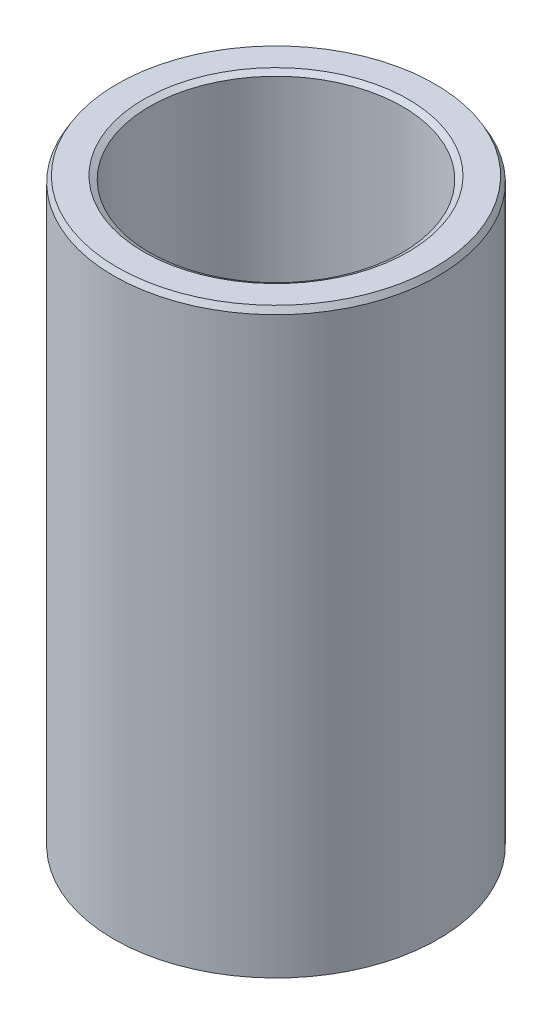
ISO-10303-21;
HEADER;
FILE_DESCRIPTION(('STEP AP214'),'2;1');
FILE_NAME('part.step','',(''),(''),'','','');
FILE_SCHEMA(('AUTOMOTIVE_DESIGN { 1 0 10303 214 1 1 1 1 }'));
ENDSEC;
DATA;
#1=APPLICATION_CONTEXT('core data for automotive mechanical design processes');
#2=APPLICATION_PROTOCOL_DEFINITION('international standard','automotive_design',2000,#1);
#3=PRODUCT_CONTEXT('',#1,'mechanical');
#4=PRODUCT('Part','Part','',(#3));
#5=PRODUCT_RELATED_PRODUCT_CATEGORY('part','',(#4));
#6=PRODUCT_DEFINITION_FORMATION('','',#4);
#7=PRODUCT_DEFINITION_CONTEXT('part definition',#1,'design');
#8=PRODUCT_DEFINITION('design','',#6,#7);
#9=PRODUCT_DEFINITION_SHAPE('','',#8);
#10=(LENGTH_UNIT() NAMED_UNIT(*) SI_UNIT(.MILLI.,.METRE.));
#11=(NAMED_UNIT(*) PLANE_ANGLE_UNIT() SI_UNIT($,.RADIAN.));
#12=(NAMED_UNIT(*) SI_UNIT($,.STERADIAN.) SOLID_ANGLE_UNIT());
#13=UNCERTAINTY_MEASURE_WITH_UNIT(LENGTH_MEASURE(1.E-05),#10,'distance_accuracy_value','');
#14=(GEOMETRIC_REPRESENTATION_CONTEXT(3) GLOBAL_UNCERTAINTY_ASSIGNED_CONTEXT((#13)) GLOBAL_UNIT_ASSIGNED_CONTEXT((#10,
#11,#12)) REPRESENTATION_CONTEXT('',''));
#15=CARTESIAN_POINT('',(0.,0.,0.));
#16=DIRECTION('',(0.,0.,1.));
#17=DIRECTION('',(1.,0.,0.));
#18=AXIS2_PLACEMENT_3D('',#15,#16,#17);
#19=CARTESIAN_POINT('',(0.,170.918902360832,0.));
#20=DIRECTION('',(0.,-1.,0.));
#21=DIRECTION('',(0.,0.,-1.));
#22=AXIS2_PLACEMENT_3D('',#19,#20,#21);
#23=CYLINDRICAL_SURFACE('',#22,47.5);
#24=CARTESIAN_POINT('',(0.,0.981822184333181,0.));
#25=DIRECTION('',(0.,1.,0.));
#26=DIRECTION('',(0.,0.,1.));
#27=AXIS2_PLACEMENT_3D('',#24,#25,#26);
#28=CIRCLE('',#27,47.5);
#29=CARTESIAN_POINT('',(0.,0.981822184333181,47.5));
#30=VERTEX_POINT('',#29);
#31=EDGE_CURVE('E10',#30,#30,#28,.T.);
#32=ORIENTED_EDGE('',*,*,#31,.T.);
#33=EDGE_LOOP('',(#32));
#34=FACE_BOUND('',#33,.T.);
#35=CARTESIAN_POINT('',(0.,169.218336453569,0.));
#36=DIRECTION('',(0.,1.,0.));
#37=DIRECTION('',(0.,0.,1.));
#38=AXIS2_PLACEMENT_3D('',#35,#36,#37);
#39=CIRCLE('',#38,47.5);
#40=CARTESIAN_POINT('',(0.,169.218336453569,47.5));
#41=VERTEX_POINT('',#40);
#42=EDGE_CURVE('E50',#41,#41,#39,.F.);
#43=ORIENTED_EDGE('',*,*,#42,.T.);
#44=EDGE_LOOP('',(#43));
#45=FACE_BOUND('',#44,.T.);
#46=ADVANCED_FACE('F39',(#34,#45),#23,.T.);
#47=CARTESIAN_POINT('',(0.,170.918902360832,0.));
#48=DIRECTION('',(0.,1.,0.));
#49=DIRECTION('',(0.,0.,1.));
#50=AXIS2_PLACEMENT_3D('',#47,#48,#49);
#51=PLANE('',#50);
#52=CARTESIAN_POINT('',(0.,170.918902360832,0.));
#53=DIRECTION('',(0.,1.,0.));
#54=DIRECTION('',(0.,0.,1.));
#55=AXIS2_PLACEMENT_3D('',#52,#53,#54);
#56=CIRCLE('',#55,38.7370418728421);
#57=CARTESIAN_POINT('',(0.,170.918902360832,38.7370418728421));
#58=VERTEX_POINT('',#57);
#59=EDGE_CURVE('E58',#58,#58,#56,.F.);
#60=ORIENTED_EDGE('',*,*,#59,.T.);
#61=EDGE_LOOP('',(#60));
#62=FACE_BOUND('',#61,.T.);
#63=CARTESIAN_POINT('',(0.,170.918902360832,0.));
#64=DIRECTION('',(0.,1.,0.));
#65=DIRECTION('',(0.,0.,1.));
#66=AXIS2_PLACEMENT_3D('',#63,#64,#65);
#67=CIRCLE('',#66,46.5181778156668);
#68=CARTESIAN_POINT('',(0.,170.918902360832,46.5181778156668));
#69=VERTEX_POINT('',#68);
#70=EDGE_CURVE('E61',#69,#69,#67,.T.);
#71=ORIENTED_EDGE('',*,*,#70,.T.);
#72=EDGE_LOOP('',(#71));
#73=FACE_BOUND('',#72,.T.);
#74=ADVANCED_FACE('F88',(#62,#73),#51,.T.);
#75=CARTESIAN_POINT('',(0.,0.,0.));
#76=DIRECTION('',(0.,1.,0.));
#77=DIRECTION('',(0.,0.,1.));
#78=AXIS2_PLACEMENT_3D('',#75,#76,#77);
#79=PLANE('',#78);
#80=CARTESIAN_POINT('',(0.,0.,0.));
#81=DIRECTION('',(0.,1.,0.));
#82=DIRECTION('',(0.,0.,1.));
#83=AXIS2_PLACEMENT_3D('',#80,#81,#82);
#84=CIRCLE('',#83,38.0182981499119);
#85=CARTESIAN_POINT('',(0.,0.,38.0182981499119));
#86=VERTEX_POINT('',#85);
#87=EDGE_CURVE('E51',#86,#86,#84,.T.);
#88=ORIENTED_EDGE('',*,*,#87,.T.);
#89=EDGE_LOOP('',(#88));
#90=FACE_BOUND('',#89,.T.);
#91=CARTESIAN_POINT('',(0.,0.,0.));
#92=DIRECTION('',(0.,1.,0.));
#93=DIRECTION('',(0.,0.,1.));
#94=AXIS2_PLACEMENT_3D('',#91,#92,#93);
#95=CIRCLE('',#94,45.7994340927367);
#96=CARTESIAN_POINT('',(0.,0.,45.7994340927367));
#97=VERTEX_POINT('',#96);
#98=EDGE_CURVE('E54',#97,#97,#95,.F.);
#99=ORIENTED_EDGE('',*,*,#98,.T.);
#100=EDGE_LOOP('',(#99));
#101=FACE_BOUND('',#100,.T.);
#102=ADVANCED_FACE('F83',(#90,#101),#79,.F.);
#103=CARTESIAN_POINT('',(0.,170.918902360832,0.));
#104=DIRECTION('',(0.,-1.,0.));
#105=DIRECTION('',(0.,0.,-1.));
#106=AXIS2_PLACEMENT_3D('',#103,#104,#105);
#107=CYLINDRICAL_SURFACE('',#106,37.0364759655788);
#108=CARTESIAN_POINT('',(0.,169.937080176499,0.));
#109=DIRECTION('',(0.,1.,0.));
#110=DIRECTION('',(0.,0.,1.));
#111=AXIS2_PLACEMENT_3D('',#108,#109,#110);
#112=CIRCLE('',#111,37.0364759655788);
#113=CARTESIAN_POINT('',(0.,169.937080176499,37.0364759655788));
#114=VERTEX_POINT('',#113);
#115=EDGE_CURVE('E67',#114,#114,#112,.T.);
#116=ORIENTED_EDGE('',*,*,#115,.T.);
#117=EDGE_LOOP('',(#116));
#118=FACE_BOUND('',#117,.T.);
#119=CARTESIAN_POINT('',(0.,1.70056590726331,0.));
#120=DIRECTION('',(0.,1.,0.));
#121=DIRECTION('',(0.,0.,1.));
#122=AXIS2_PLACEMENT_3D('',#119,#120,#121);
#123=CIRCLE('',#122,37.0364759655788);
#124=CARTESIAN_POINT('',(0.,1.70056590726331,37.0364759655788));
#125=VERTEX_POINT('',#124);
#126=EDGE_CURVE('E69',#125,#125,#123,.F.);
#127=ORIENTED_EDGE('',*,*,#126,.T.);
#128=EDGE_LOOP('',(#127));
#129=FACE_BOUND('',#128,.T.);
#130=ADVANCED_FACE('F71',(#118,#129),#107,.F.);
#131=CARTESIAN_POINT('',(0.,169.937080176499,0.));
#132=DIRECTION('',(0.,1.,0.));
#133=DIRECTION('',(0.,0.,1.));
#134=AXIS2_PLACEMENT_3D('',#131,#132,#133);
#135=CONICAL_SURFACE('',#134,37.0364759655788,1.0471975511966);
#136=ORIENTED_EDGE('',*,*,#59,.F.);
#137=EDGE_LOOP('',(#136));
#138=FACE_BOUND('',#137,.T.);
#139=ORIENTED_EDGE('',*,*,#115,.F.);
#140=EDGE_LOOP('',(#139));
#141=FACE_BOUND('',#140,.T.);
#142=ADVANCED_FACE('F77',(#138,#141),#135,.F.);
#143=CARTESIAN_POINT('',(0.,0.,0.));
#144=DIRECTION('',(0.,-1.,0.));
#145=DIRECTION('',(0.,0.,-1.));
#146=AXIS2_PLACEMENT_3D('',#143,#144,#145);
#147=CONICAL_SURFACE('',#146,38.0182981499119,0.523598775598291);
#148=ORIENTED_EDGE('',*,*,#126,.F.);
#149=EDGE_LOOP('',(#148));
#150=FACE_BOUND('',#149,.T.);
#151=ORIENTED_EDGE('',*,*,#87,.F.);
#152=EDGE_LOOP('',(#151));
#153=FACE_BOUND('',#152,.T.);
#154=ADVANCED_FACE('F73',(#150,#153),#147,.F.);
#155=CARTESIAN_POINT('',(0.,0.981822184333181,0.));
#156=DIRECTION('',(0.,1.,0.));
#157=DIRECTION('',(0.,0.,1.));
#158=AXIS2_PLACEMENT_3D('',#155,#156,#157);
#159=CONICAL_SURFACE('',#158,47.5,1.04719755119659);
#160=ORIENTED_EDGE('',*,*,#98,.F.);
#161=EDGE_LOOP('',(#160));
#162=FACE_BOUND('',#161,.T.);
#163=ORIENTED_EDGE('',*,*,#31,.F.);
#164=EDGE_LOOP('',(#163));
#165=FACE_BOUND('',#164,.T.);
#166=ADVANCED_FACE('F76',(#162,#165),#159,.T.);
#167=CARTESIAN_POINT('',(0.,170.918902360832,0.));
#168=DIRECTION('',(0.,-1.,0.));
#169=DIRECTION('',(0.,0.,-1.));
#170=AXIS2_PLACEMENT_3D('',#167,#168,#169);
#171=CONICAL_SURFACE('',#170,46.5181778156668,0.523598775598292);
#172=ORIENTED_EDGE('',*,*,#42,.F.);
#173=EDGE_LOOP('',(#172));
#174=FACE_BOUND('',#173,.T.);
#175=ORIENTED_EDGE('',*,*,#70,.F.);
#176=EDGE_LOOP('',(#175));
#177=FACE_BOUND('',#176,.T.);
#178=ADVANCED_FACE('F45',(#174,#177),#171,.T.);
#179=CLOSED_SHELL('',(#46,#74,#102,#130,#142,#154,#166,#178));
#180=MANIFOLD_SOLID_BREP('B2',#179);
#181=ADVANCED_BREP_SHAPE_REPRESENTATION('',(#18,#180),#14);
#182=SHAPE_DEFINITION_REPRESENTATION(#9,#181);
ENDSEC;
END-ISO-10303-21;
